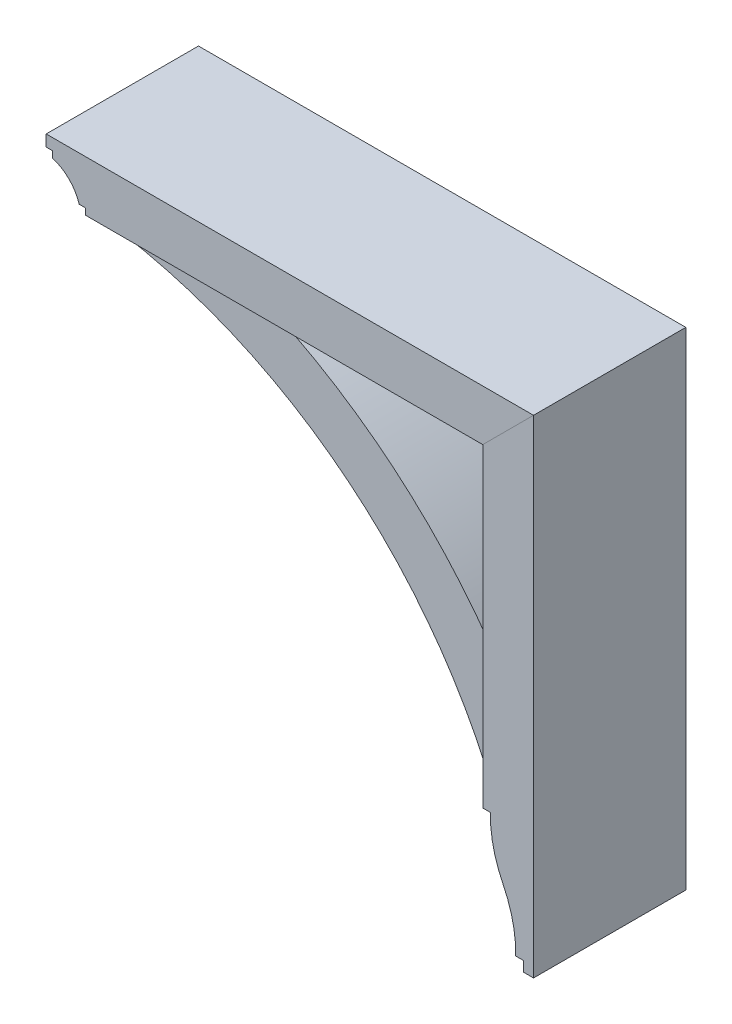
ISO-10303-21;
HEADER;
FILE_DESCRIPTION(('STEP AP214'),'2;1');
FILE_NAME('part.step','',(''),(''),'','','');
FILE_SCHEMA(('AUTOMOTIVE_DESIGN { 1 0 10303 214 1 1 1 1 }'));
ENDSEC;
DATA;
#1=APPLICATION_CONTEXT('core data for automotive mechanical design processes');
#2=APPLICATION_PROTOCOL_DEFINITION('international standard','automotive_design',2000,#1);
#3=PRODUCT_CONTEXT('',#1,'mechanical');
#4=PRODUCT('Part','Part','',(#3));
#5=PRODUCT_RELATED_PRODUCT_CATEGORY('part','',(#4));
#6=PRODUCT_DEFINITION_FORMATION('','',#4);
#7=PRODUCT_DEFINITION_CONTEXT('part definition',#1,'design');
#8=PRODUCT_DEFINITION('design','',#6,#7);
#9=PRODUCT_DEFINITION_SHAPE('','',#8);
#10=(LENGTH_UNIT() NAMED_UNIT(*) SI_UNIT(.MILLI.,.METRE.));
#11=(NAMED_UNIT(*) PLANE_ANGLE_UNIT() SI_UNIT($,.RADIAN.));
#12=(NAMED_UNIT(*) SI_UNIT($,.STERADIAN.) SOLID_ANGLE_UNIT());
#13=UNCERTAINTY_MEASURE_WITH_UNIT(LENGTH_MEASURE(1.E-05),#10,'distance_accuracy_value','');
#14=(GEOMETRIC_REPRESENTATION_CONTEXT(3) GLOBAL_UNCERTAINTY_ASSIGNED_CONTEXT((#13)) GLOBAL_UNIT_ASSIGNED_CONTEXT((#10,
#11,#12)) REPRESENTATION_CONTEXT('',''));
#15=CARTESIAN_POINT('',(0.,0.,0.));
#16=DIRECTION('',(0.,0.,1.));
#17=DIRECTION('',(1.,0.,0.));
#18=AXIS2_PLACEMENT_3D('',#15,#16,#17);
#19=CARTESIAN_POINT('',(0.,-183.515,95.25));
#20=DIRECTION('',(0.,1.,0.));
#21=DIRECTION('',(0.,0.,1.));
#22=AXIS2_PLACEMENT_3D('',#19,#20,#21);
#23=PLANE('',#22);
#24=DIRECTION('',(1.,0.,0.));
#25=VECTOR('',#24,1.);
#26=CARTESIAN_POINT('',(0.,-183.515,-95.25));
#27=LINE('',#26,#25);
#28=CARTESIAN_POINT('',(234.181223015556,-183.515,-95.25));
#29=VERTEX_POINT('',#28);
#30=CARTESIAN_POINT('',(243.706223015556,-183.515,-95.25));
#31=VERTEX_POINT('',#30);
#32=EDGE_CURVE('E169',#29,#31,#27,.T.);
#33=ORIENTED_EDGE('',*,*,#32,.T.);
#34=DIRECTION('',(0.,0.,-1.));
#35=VECTOR('',#34,1.);
#36=CARTESIAN_POINT('',(243.706223015556,-183.515,95.25));
#37=LINE('',#36,#35);
#38=CARTESIAN_POINT('',(243.706223015556,-183.515,95.25));
#39=VERTEX_POINT('',#38);
#40=EDGE_CURVE('E12',#39,#31,#37,.T.);
#41=ORIENTED_EDGE('',*,*,#40,.F.);
#42=DIRECTION('',(1.,0.,0.));
#43=VECTOR('',#42,1.);
#44=CARTESIAN_POINT('',(0.,-183.515,95.25));
#45=LINE('',#44,#43);
#46=CARTESIAN_POINT('',(234.181223015556,-183.515,95.25));
#47=VERTEX_POINT('',#46);
#48=EDGE_CURVE('E198',#47,#39,#45,.T.);
#49=ORIENTED_EDGE('',*,*,#48,.F.);
#50=DIRECTION('',(0.,0.,-1.));
#51=VECTOR('',#50,1.);
#52=CARTESIAN_POINT('',(234.181223015556,-183.515,95.25));
#53=LINE('',#52,#51);
#54=EDGE_CURVE('E165',#47,#29,#53,.T.);
#55=ORIENTED_EDGE('',*,*,#54,.T.);
#56=EDGE_LOOP('',(#33,#41,#49,#55));
#57=FACE_BOUND('',#56,.T.);
#58=ADVANCED_FACE('F60',(#57),#23,.F.);
#59=CARTESIAN_POINT('',(394.498691596048,-185.972961686252,95.25));
#60=DIRECTION('',(0.,0.,-1.));
#61=DIRECTION('',(-1.,0.,0.));
#62=AXIS2_PLACEMENT_3D('',#59,#60,#61);
#63=CYLINDRICAL_SURFACE('',#62,150.8125);
#64=CARTESIAN_POINT('',(394.498691596048,-185.972961686252,-95.25));
#65=DIRECTION('',(0.,0.,1.));
#66=DIRECTION('',(1.,0.,0.));
#67=AXIS2_PLACEMENT_3D('',#64,#65,#66);
#68=CIRCLE('',#67,150.8125);
#69=CARTESIAN_POINT('',(259.581223015556,-253.365,-95.25));
#70=VERTEX_POINT('',#69);
#71=EDGE_CURVE('E173',#31,#70,#68,.T.);
#72=ORIENTED_EDGE('',*,*,#71,.T.);
#73=DIRECTION('',(0.,0.,-1.));
#74=VECTOR('',#73,1.);
#75=CARTESIAN_POINT('',(259.581223015556,-253.365,95.25));
#76=LINE('',#75,#74);
#77=CARTESIAN_POINT('',(259.581223015556,-253.365,95.25));
#78=VERTEX_POINT('',#77);
#79=EDGE_CURVE('E69',#78,#70,#76,.T.);
#80=ORIENTED_EDGE('',*,*,#79,.F.);
#81=CARTESIAN_POINT('',(394.498691596048,-185.972961686252,95.25));
#82=DIRECTION('',(0.,0.,1.));
#83=DIRECTION('',(1.,0.,0.));
#84=AXIS2_PLACEMENT_3D('',#81,#82,#83);
#85=CIRCLE('',#84,150.8125);
#86=EDGE_CURVE('E123',#39,#78,#85,.T.);
#87=ORIENTED_EDGE('',*,*,#86,.F.);
#88=ORIENTED_EDGE('',*,*,#40,.T.);
#89=EDGE_LOOP('',(#72,#80,#87,#88));
#90=FACE_BOUND('',#89,.T.);
#91=ADVANCED_FACE('F220',(#90),#63,.T.);
#92=CARTESIAN_POINT('',(124.663754435066,-320.757038313746,95.25));
#93=DIRECTION('',(0.,0.,-1.));
#94=DIRECTION('',(-1.,0.,0.));
#95=AXIS2_PLACEMENT_3D('',#92,#93,#94);
#96=CYLINDRICAL_SURFACE('',#95,150.812499999996);
#97=CARTESIAN_POINT('',(124.663754435066,-320.757038313746,-95.25));
#98=DIRECTION('',(0.,0.,1.));
#99=DIRECTION('',(1.,0.,0.));
#100=AXIS2_PLACEMENT_3D('',#97,#98,#99);
#101=CIRCLE('',#100,150.812499999996);
#102=CARTESIAN_POINT('',(275.456223015555,-323.215,-95.25));
#103=VERTEX_POINT('',#102);
#104=EDGE_CURVE('E176',#103,#70,#101,.T.);
#105=ORIENTED_EDGE('',*,*,#104,.F.);
#106=DIRECTION('',(0.,0.,-1.));
#107=VECTOR('',#106,1.);
#108=CARTESIAN_POINT('',(275.456223015555,-323.215,95.25));
#109=LINE('',#108,#107);
#110=CARTESIAN_POINT('',(275.456223015555,-323.215,95.25));
#111=VERTEX_POINT('',#110);
#112=EDGE_CURVE('E211',#111,#103,#109,.T.);
#113=ORIENTED_EDGE('',*,*,#112,.F.);
#114=CARTESIAN_POINT('',(124.663754435066,-320.757038313746,95.25));
#115=DIRECTION('',(0.,0.,1.));
#116=DIRECTION('',(1.,0.,0.));
#117=AXIS2_PLACEMENT_3D('',#114,#115,#116);
#118=CIRCLE('',#117,150.812499999996);
#119=EDGE_CURVE('E219',#111,#78,#118,.T.);
#120=ORIENTED_EDGE('',*,*,#119,.T.);
#121=ORIENTED_EDGE('',*,*,#79,.T.);
#122=EDGE_LOOP('',(#105,#113,#120,#121));
#123=FACE_BOUND('',#122,.T.);
#124=ADVANCED_FACE('F217',(#123),#96,.F.);
#125=CARTESIAN_POINT('',(1.88367839844737E-12,-323.215000000002,95.25));
#126=DIRECTION('',(0.,-1.,0.));
#127=DIRECTION('',(1.,0.,0.));
#128=AXIS2_PLACEMENT_3D('',#125,#126,#127);
#129=PLANE('',#128);
#130=DIRECTION('',(-1.,0.,0.));
#131=VECTOR('',#130,1.);
#132=CARTESIAN_POINT('',(1.88367839844737E-12,-323.215000000002,-95.25));
#133=LINE('',#132,#131);
#134=CARTESIAN_POINT('',(284.981223015555,-323.215,-95.25));
#135=VERTEX_POINT('',#134);
#136=EDGE_CURVE('E180',#135,#103,#133,.T.);
#137=ORIENTED_EDGE('',*,*,#136,.F.);
#138=DIRECTION('',(0.,0.,-1.));
#139=VECTOR('',#138,1.);
#140=CARTESIAN_POINT('',(284.981223015555,-323.215,95.25));
#141=LINE('',#140,#139);
#142=CARTESIAN_POINT('',(284.981223015555,-323.215,95.25));
#143=VERTEX_POINT('',#142);
#144=EDGE_CURVE('E208',#143,#135,#141,.T.);
#145=ORIENTED_EDGE('',*,*,#144,.F.);
#146=DIRECTION('',(-1.,0.,0.));
#147=VECTOR('',#146,1.);
#148=CARTESIAN_POINT('',(1.88367839844737E-12,-323.215000000002,95.25));
#149=LINE('',#148,#147);
#150=EDGE_CURVE('E231',#143,#111,#149,.T.);
#151=ORIENTED_EDGE('',*,*,#150,.T.);
#152=ORIENTED_EDGE('',*,*,#112,.T.);
#153=EDGE_LOOP('',(#137,#145,#151,#152));
#154=FACE_BOUND('',#153,.T.);
#155=ADVANCED_FACE('F228',(#154),#129,.T.);
#156=CARTESIAN_POINT('',(284.981223015554,1.24564061172325E-12,95.25));
#157=DIRECTION('',(-1.,0.,0.));
#158=DIRECTION('',(0.,-1.,0.));
#159=AXIS2_PLACEMENT_3D('',#156,#157,#158);
#160=PLANE('',#159);
#161=DIRECTION('',(0.,1.,0.));
#162=VECTOR('',#161,1.);
#163=CARTESIAN_POINT('',(284.981223015554,1.24564061172325E-12,-95.25));
#164=LINE('',#163,#162);
#165=CARTESIAN_POINT('',(284.981223015555,-335.915,-95.25));
#166=VERTEX_POINT('',#165);
#167=EDGE_CURVE('E184',#166,#135,#164,.T.);
#168=ORIENTED_EDGE('',*,*,#167,.F.);
#169=DIRECTION('',(0.,0.,-1.));
#170=VECTOR('',#169,1.);
#171=CARTESIAN_POINT('',(284.981223015555,-335.915,95.25));
#172=LINE('',#171,#170);
#173=CARTESIAN_POINT('',(284.981223015555,-335.915,95.25));
#174=VERTEX_POINT('',#173);
#175=EDGE_CURVE('E205',#174,#166,#172,.T.);
#176=ORIENTED_EDGE('',*,*,#175,.F.);
#177=DIRECTION('',(0.,1.,0.));
#178=VECTOR('',#177,1.);
#179=CARTESIAN_POINT('',(284.981223015554,1.24564061172325E-12,95.25));
#180=LINE('',#179,#178);
#181=EDGE_CURVE('E236',#174,#143,#180,.T.);
#182=ORIENTED_EDGE('',*,*,#181,.T.);
#183=ORIENTED_EDGE('',*,*,#144,.T.);
#184=EDGE_LOOP('',(#168,#176,#182,#183));
#185=FACE_BOUND('',#184,.T.);
#186=ADVANCED_FACE('F269',(#185),#160,.T.);
#187=CARTESIAN_POINT('',(-1.46826995006676E-12,-335.914999999999,95.25));
#188=DIRECTION('',(0.,-1.,0.));
#189=DIRECTION('',(1.,0.,0.));
#190=AXIS2_PLACEMENT_3D('',#187,#188,#189);
#191=PLANE('',#190);
#192=DIRECTION('',(-1.,0.,0.));
#193=VECTOR('',#192,1.);
#194=CARTESIAN_POINT('',(-1.46826995006676E-12,-335.914999999999,-95.25));
#195=LINE('',#194,#193);
#196=CARTESIAN_POINT('',(297.681223015555,-335.915,-95.25));
#197=VERTEX_POINT('',#196);
#198=EDGE_CURVE('E188',#197,#166,#195,.T.);
#199=ORIENTED_EDGE('',*,*,#198,.F.);
#200=DIRECTION('',(0.,0.,-1.));
#201=VECTOR('',#200,1.);
#202=CARTESIAN_POINT('',(297.681223015555,-335.915,95.25));
#203=LINE('',#202,#201);
#204=CARTESIAN_POINT('',(297.681223015555,-335.915,95.25));
#205=VERTEX_POINT('',#204);
#206=EDGE_CURVE('E156',#205,#197,#203,.T.);
#207=ORIENTED_EDGE('',*,*,#206,.F.);
#208=DIRECTION('',(-1.,0.,0.));
#209=VECTOR('',#208,1.);
#210=CARTESIAN_POINT('',(-1.46826995006676E-12,-335.914999999999,95.25));
#211=LINE('',#210,#209);
#212=EDGE_CURVE('E147',#205,#174,#211,.T.);
#213=ORIENTED_EDGE('',*,*,#212,.T.);
#214=ORIENTED_EDGE('',*,*,#175,.T.);
#215=EDGE_LOOP('',(#199,#207,#213,#214));
#216=FACE_BOUND('',#215,.T.);
#217=ADVANCED_FACE('F245',(#216),#191,.T.);
#218=CARTESIAN_POINT('',(297.681223015555,0.,95.25));
#219=DIRECTION('',(-1.,0.,0.));
#220=DIRECTION('',(0.,-1.,0.));
#221=AXIS2_PLACEMENT_3D('',#218,#219,#220);
#222=PLANE('',#221);
#223=DIRECTION('',(0.,1.,0.));
#224=VECTOR('',#223,1.);
#225=CARTESIAN_POINT('',(297.681223015555,0.,-95.25));
#226=LINE('',#225,#224);
#227=CARTESIAN_POINT('',(297.681223015555,273.685,-95.25));
#228=VERTEX_POINT('',#227);
#229=EDGE_CURVE('E154',#197,#228,#226,.T.);
#230=ORIENTED_EDGE('',*,*,#229,.T.);
#231=DIRECTION('',(0.,0.,-1.));
#232=VECTOR('',#231,1.);
#233=CARTESIAN_POINT('',(297.681223015555,273.685,95.25));
#234=LINE('',#233,#232);
#235=CARTESIAN_POINT('',(297.681223015555,273.685,95.25));
#236=VERTEX_POINT('',#235);
#237=EDGE_CURVE('E151',#236,#228,#234,.T.);
#238=ORIENTED_EDGE('',*,*,#237,.F.);
#239=DIRECTION('',(0.,1.,0.));
#240=VECTOR('',#239,1.);
#241=CARTESIAN_POINT('',(297.681223015555,0.,95.25));
#242=LINE('',#241,#240);
#243=EDGE_CURVE('E140',#205,#236,#242,.T.);
#244=ORIENTED_EDGE('',*,*,#243,.F.);
#245=ORIENTED_EDGE('',*,*,#206,.T.);
#246=EDGE_LOOP('',(#230,#238,#244,#245));
#247=FACE_BOUND('',#246,.T.);
#248=ADVANCED_FACE('F152',(#247),#222,.F.);
#249=CARTESIAN_POINT('',(11.9981115077795,-11.9981115077793,95.25));
#250=DIRECTION('',(0.707106781186552,-0.707106781186543,0.));
#251=DIRECTION('',(0.707106781186543,0.707106781186552,0.));
#252=AXIS2_PLACEMENT_3D('',#249,#250,#251);
#253=PLANE('',#252);
#254=DIRECTION('',(-0.707106781186543,-0.707106781186552,0.));
#255=VECTOR('',#254,1.);
#256=CARTESIAN_POINT('',(11.9981115077795,-11.9981115077793,-95.25));
#257=LINE('',#256,#255);
#258=CARTESIAN_POINT('',(234.181223015556,210.185,-95.25));
#259=VERTEX_POINT('',#258);
#260=EDGE_CURVE('E109',#228,#259,#257,.T.);
#261=ORIENTED_EDGE('',*,*,#260,.T.);
#262=DIRECTION('',(0.,0.,-1.));
#263=VECTOR('',#262,1.);
#264=CARTESIAN_POINT('',(234.181223015556,210.185,95.25));
#265=LINE('',#264,#263);
#266=CARTESIAN_POINT('',(234.181223015556,210.185,95.25));
#267=VERTEX_POINT('',#266);
#268=EDGE_CURVE('E157',#267,#259,#265,.T.);
#269=ORIENTED_EDGE('',*,*,#268,.F.);
#270=DIRECTION('',(-0.707106781186543,-0.707106781186552,0.));
#271=VECTOR('',#270,1.);
#272=CARTESIAN_POINT('',(11.9981115077795,-11.9981115077793,95.25));
#273=LINE('',#272,#271);
#274=EDGE_CURVE('E144',#236,#267,#273,.T.);
#275=ORIENTED_EDGE('',*,*,#274,.F.);
#276=ORIENTED_EDGE('',*,*,#237,.T.);
#277=EDGE_LOOP('',(#261,#269,#275,#276));
#278=FACE_BOUND('',#277,.T.);
#279=ADVANCED_FACE('F159',(#278),#253,.F.);
#280=CARTESIAN_POINT('',(234.181223015556,0.,95.25));
#281=DIRECTION('',(1.,0.,0.));
#282=DIRECTION('',(0.,1.,0.));
#283=AXIS2_PLACEMENT_3D('',#280,#281,#282);
#284=PLANE('',#283);
#285=DIRECTION('',(0.,-1.,0.));
#286=VECTOR('',#285,1.);
#287=CARTESIAN_POINT('',(234.181223015556,0.,-95.25));
#288=LINE('',#287,#286);
#289=EDGE_CURVE('E115',#259,#29,#288,.T.);
#290=ORIENTED_EDGE('',*,*,#289,.T.);
#291=ORIENTED_EDGE('',*,*,#54,.F.);
#292=DIRECTION('',(0.,-1.,0.));
#293=VECTOR('',#292,1.);
#294=CARTESIAN_POINT('',(234.181223015556,0.,95.25));
#295=LINE('',#294,#293);
#296=EDGE_CURVE('E77',#267,#47,#295,.T.);
#297=ORIENTED_EDGE('',*,*,#296,.F.);
#298=ORIENTED_EDGE('',*,*,#268,.T.);
#299=EDGE_LOOP('',(#290,#291,#297,#298));
#300=FACE_BOUND('',#299,.T.);
#301=ADVANCED_FACE('F248',(#300),#284,.F.);
#302=CARTESIAN_POINT('',(0.,0.,95.25));
#303=DIRECTION('',(0.,0.,1.));
#304=DIRECTION('',(1.,0.,0.));
#305=AXIS2_PLACEMENT_3D('',#302,#303,#304);
#306=PLANE('',#305);
#307=ORIENTED_EDGE('',*,*,#48,.T.);
#308=ORIENTED_EDGE('',*,*,#86,.T.);
#309=ORIENTED_EDGE('',*,*,#119,.F.);
#310=ORIENTED_EDGE('',*,*,#150,.F.);
#311=ORIENTED_EDGE('',*,*,#181,.F.);
#312=ORIENTED_EDGE('',*,*,#212,.F.);
#313=ORIENTED_EDGE('',*,*,#243,.T.);
#314=ORIENTED_EDGE('',*,*,#274,.T.);
#315=ORIENTED_EDGE('',*,*,#296,.T.);
#316=EDGE_LOOP('',(#307,#308,#309,#310,#311,#312,#313,#314,#315));
#317=FACE_BOUND('',#316,.T.);
#318=ADVANCED_FACE('F142',(#317),#306,.T.);
#319=CARTESIAN_POINT('',(0.,0.,-95.25));
#320=DIRECTION('',(0.,0.,1.));
#321=DIRECTION('',(1.,0.,0.));
#322=AXIS2_PLACEMENT_3D('',#319,#320,#321);
#323=PLANE('',#322);
#324=ORIENTED_EDGE('',*,*,#32,.F.);
#325=ORIENTED_EDGE('',*,*,#289,.F.);
#326=ORIENTED_EDGE('',*,*,#260,.F.);
#327=ORIENTED_EDGE('',*,*,#229,.F.);
#328=ORIENTED_EDGE('',*,*,#198,.T.);
#329=ORIENTED_EDGE('',*,*,#167,.T.);
#330=ORIENTED_EDGE('',*,*,#136,.T.);
#331=ORIENTED_EDGE('',*,*,#104,.T.);
#332=ORIENTED_EDGE('',*,*,#71,.F.);
#333=EDGE_LOOP('',(#324,#325,#326,#327,#328,#329,#330,#331,#332));
#334=FACE_BOUND('',#333,.T.);
#335=ADVANCED_FACE('F224',(#334),#323,.F.);
#336=CLOSED_SHELL('',(#58,#91,#124,#155,#186,#217,#248,#279,#301,#318,#335));
#337=MANIFOLD_SOLID_BREP('B2',#336);
#338=CARTESIAN_POINT('',(-334.570737895892,-414.691103093737,69.85));
#339=DIRECTION('',(0.,0.,-1.));
#340=DIRECTION('',(-1.,0.,0.));
#341=AXIS2_PLACEMENT_3D('',#338,#339,#340);
#342=CYLINDRICAL_SURFACE('',#341,674.6875);
#343=CARTESIAN_POINT('',(-334.570737895892,-414.691103093737,-69.85));
#344=DIRECTION('',(0.,0.,1.));
#345=DIRECTION('',(1.,0.,0.));
#346=AXIS2_PLACEMENT_3D('',#343,#344,#345);
#347=CIRCLE('',#346,674.6875);
#348=CARTESIAN_POINT('',(-80.1437769844444,210.185,-69.85));
#349=VERTEX_POINT('',#348);
#350=CARTESIAN_POINT('',(234.181223015556,-51.7525000000003,-69.85));
#351=VERTEX_POINT('',#350);
#352=EDGE_CURVE('E461',#349,#351,#347,.F.);
#353=ORIENTED_EDGE('',*,*,#352,.F.);
#354=DIRECTION('',(0.,0.,-1.));
#355=VECTOR('',#354,1.);
#356=CARTESIAN_POINT('',(-80.1437769844444,210.185,69.85));
#357=LINE('',#356,#355);
#358=CARTESIAN_POINT('',(-80.1437769844444,210.185,69.85));
#359=VERTEX_POINT('',#358);
#360=EDGE_CURVE('E58',#359,#349,#357,.T.);
#361=ORIENTED_EDGE('',*,*,#360,.F.);
#362=CARTESIAN_POINT('',(-334.570737895892,-414.691103093737,69.85));
#363=DIRECTION('',(0.,0.,1.));
#364=DIRECTION('',(1.,0.,0.));
#365=AXIS2_PLACEMENT_3D('',#362,#363,#364);
#366=CIRCLE('',#365,674.6875);
#367=CARTESIAN_POINT('',(234.181223015556,-51.7525000000003,69.85));
#368=VERTEX_POINT('',#367);
#369=EDGE_CURVE('E478',#359,#368,#366,.F.);
#370=ORIENTED_EDGE('',*,*,#369,.T.);
#371=DIRECTION('',(0.,0.,-1.));
#372=VECTOR('',#371,1.);
#373=CARTESIAN_POINT('',(234.181223015556,-51.7525000000003,69.85));
#374=LINE('',#373,#372);
#375=EDGE_CURVE('E389',#368,#351,#374,.T.);
#376=ORIENTED_EDGE('',*,*,#375,.T.);
#377=EDGE_LOOP('',(#353,#361,#370,#376));
#378=FACE_BOUND('',#377,.T.);
#379=ADVANCED_FACE('F372',(#378),#342,.T.);
#380=CARTESIAN_POINT('',(0.,210.185,69.85));
#381=DIRECTION('',(0.,1.,0.));
#382=DIRECTION('',(-1.,0.,0.));
#383=AXIS2_PLACEMENT_3D('',#380,#381,#382);
#384=PLANE('',#383);
#385=DIRECTION('',(1.,0.,0.));
#386=VECTOR('',#385,1.);
#387=CARTESIAN_POINT('',(0.,210.185,-69.85));
#388=LINE('',#387,#386);
#389=CARTESIAN_POINT('',(-240.481276984445,210.185,-69.85));
#390=VERTEX_POINT('',#389);
#391=EDGE_CURVE('E464',#390,#349,#388,.T.);
#392=ORIENTED_EDGE('',*,*,#391,.F.);
#393=DIRECTION('',(0.,0.,-1.));
#394=VECTOR('',#393,1.);
#395=CARTESIAN_POINT('',(-240.481276984445,210.185,69.85));
#396=LINE('',#395,#394);
#397=CARTESIAN_POINT('',(-240.481276984445,210.185,69.85));
#398=VERTEX_POINT('',#397);
#399=EDGE_CURVE('E381',#398,#390,#396,.T.);
#400=ORIENTED_EDGE('',*,*,#399,.F.);
#401=DIRECTION('',(1.,0.,0.));
#402=VECTOR('',#401,1.);
#403=CARTESIAN_POINT('',(0.,210.185,69.85));
#404=LINE('',#403,#402);
#405=EDGE_CURVE('E494',#398,#359,#404,.T.);
#406=ORIENTED_EDGE('',*,*,#405,.T.);
#407=ORIENTED_EDGE('',*,*,#360,.T.);
#408=EDGE_LOOP('',(#392,#400,#406,#407));
#409=FACE_BOUND('',#408,.T.);
#410=ADVANCED_FACE('F493',(#409),#384,.T.);
#411=CARTESIAN_POINT('',(-240.481276984445,-3.00323791562869E-13,69.85));
#412=DIRECTION('',(1.,0.,0.));
#413=DIRECTION('',(0.,1.,0.));
#414=AXIS2_PLACEMENT_3D('',#411,#412,#413);
#415=PLANE('',#414);
#416=DIRECTION('',(0.,-1.,0.));
#417=VECTOR('',#416,1.);
#418=CARTESIAN_POINT('',(-240.481276984445,-3.00323791562869E-13,-69.85));
#419=LINE('',#418,#417);
#420=CARTESIAN_POINT('',(-240.481276984445,187.96,-69.85));
#421=VERTEX_POINT('',#420);
#422=EDGE_CURVE('E467',#390,#421,#419,.T.);
#423=ORIENTED_EDGE('',*,*,#422,.T.);
#424=DIRECTION('',(0.,0.,-1.));
#425=VECTOR('',#424,1.);
#426=CARTESIAN_POINT('',(-240.481276984445,187.96,69.85));
#427=LINE('',#426,#425);
#428=CARTESIAN_POINT('',(-240.481276984445,187.96,69.85));
#429=VERTEX_POINT('',#428);
#430=EDGE_CURVE('E449',#429,#421,#427,.T.);
#431=ORIENTED_EDGE('',*,*,#430,.F.);
#432=DIRECTION('',(0.,-1.,0.));
#433=VECTOR('',#432,1.);
#434=CARTESIAN_POINT('',(-240.481276984445,-3.00323791562869E-13,69.85));
#435=LINE('',#434,#433);
#436=EDGE_CURVE('E435',#398,#429,#435,.T.);
#437=ORIENTED_EDGE('',*,*,#436,.F.);
#438=ORIENTED_EDGE('',*,*,#399,.T.);
#439=EDGE_LOOP('',(#423,#431,#437,#438));
#440=FACE_BOUND('',#439,.T.);
#441=ADVANCED_FACE('F487',(#440),#415,.F.);
#442=CARTESIAN_POINT('',(-342.193449871431,-411.484604649052,69.85));
#443=DIRECTION('',(0.,0.,-1.));
#444=DIRECTION('',(-1.,0.,0.));
#445=AXIS2_PLACEMENT_3D('',#442,#443,#444);
#446=CYLINDRICAL_SURFACE('',#445,608.0125);
#447=CARTESIAN_POINT('',(-342.193449871431,-411.484604649052,-69.85));
#448=DIRECTION('',(0.,0.,1.));
#449=DIRECTION('',(1.,0.,0.));
#450=AXIS2_PLACEMENT_3D('',#447,#448,#449);
#451=CIRCLE('',#450,608.0125);
#452=CARTESIAN_POINT('',(211.956223015556,-161.29,-69.85));
#453=VERTEX_POINT('',#452);
#454=EDGE_CURVE('E445',#421,#453,#451,.F.);
#455=ORIENTED_EDGE('',*,*,#454,.T.);
#456=DIRECTION('',(0.,0.,-1.));
#457=VECTOR('',#456,1.);
#458=CARTESIAN_POINT('',(211.956223015556,-161.29,69.85));
#459=LINE('',#458,#457);
#460=CARTESIAN_POINT('',(211.956223015556,-161.29,69.85));
#461=VERTEX_POINT('',#460);
#462=EDGE_CURVE('E442',#461,#453,#459,.T.);
#463=ORIENTED_EDGE('',*,*,#462,.F.);
#464=CARTESIAN_POINT('',(-342.193449871431,-411.484604649052,69.85));
#465=DIRECTION('',(0.,0.,1.));
#466=DIRECTION('',(1.,0.,0.));
#467=AXIS2_PLACEMENT_3D('',#464,#465,#466);
#468=CIRCLE('',#467,608.0125);
#469=EDGE_CURVE('E427',#429,#461,#468,.F.);
#470=ORIENTED_EDGE('',*,*,#469,.F.);
#471=ORIENTED_EDGE('',*,*,#430,.T.);
#472=EDGE_LOOP('',(#455,#463,#470,#471));
#473=FACE_BOUND('',#472,.T.);
#474=ADVANCED_FACE('F443',(#473),#446,.F.);
#475=CARTESIAN_POINT('',(-2.0142617732485E-13,-161.29,69.85));
#476=DIRECTION('',(0.,-1.,0.));
#477=DIRECTION('',(1.,0.,0.));
#478=AXIS2_PLACEMENT_3D('',#475,#476,#477);
#479=PLANE('',#478);
#480=DIRECTION('',(-1.,0.,0.));
#481=VECTOR('',#480,1.);
#482=CARTESIAN_POINT('',(-2.0142617732485E-13,-161.29,-69.85));
#483=LINE('',#482,#481);
#484=CARTESIAN_POINT('',(234.181223015556,-161.29,-69.85));
#485=VERTEX_POINT('',#484);
#486=EDGE_CURVE('E472',#485,#453,#483,.T.);
#487=ORIENTED_EDGE('',*,*,#486,.F.);
#488=DIRECTION('',(0.,0.,-1.));
#489=VECTOR('',#488,1.);
#490=CARTESIAN_POINT('',(234.181223015556,-161.29,69.85));
#491=LINE('',#490,#489);
#492=CARTESIAN_POINT('',(234.181223015556,-161.29,69.85));
#493=VERTEX_POINT('',#492);
#494=EDGE_CURVE('E408',#493,#485,#491,.T.);
#495=ORIENTED_EDGE('',*,*,#494,.F.);
#496=DIRECTION('',(-1.,0.,0.));
#497=VECTOR('',#496,1.);
#498=CARTESIAN_POINT('',(-2.0142617732485E-13,-161.29,69.85));
#499=LINE('',#498,#497);
#500=EDGE_CURVE('E432',#493,#461,#499,.T.);
#501=ORIENTED_EDGE('',*,*,#500,.T.);
#502=ORIENTED_EDGE('',*,*,#462,.T.);
#503=EDGE_LOOP('',(#487,#495,#501,#502));
#504=FACE_BOUND('',#503,.T.);
#505=ADVANCED_FACE('F451',(#504),#479,.T.);
#506=CARTESIAN_POINT('',(234.181223015556,0.,69.85));
#507=DIRECTION('',(1.,0.,0.));
#508=DIRECTION('',(0.,1.,0.));
#509=AXIS2_PLACEMENT_3D('',#506,#507,#508);
#510=PLANE('',#509);
#511=DIRECTION('',(0.,-1.,0.));
#512=VECTOR('',#511,1.);
#513=CARTESIAN_POINT('',(234.181223015556,0.,-69.85));
#514=LINE('',#513,#512);
#515=EDGE_CURVE('E474',#351,#485,#514,.T.);
#516=ORIENTED_EDGE('',*,*,#515,.F.);
#517=ORIENTED_EDGE('',*,*,#375,.F.);
#518=DIRECTION('',(0.,-1.,0.));
#519=VECTOR('',#518,1.);
#520=CARTESIAN_POINT('',(234.181223015556,0.,69.85));
#521=LINE('',#520,#519);
#522=EDGE_CURVE('E453',#368,#493,#521,.T.);
#523=ORIENTED_EDGE('',*,*,#522,.T.);
#524=ORIENTED_EDGE('',*,*,#494,.T.);
#525=EDGE_LOOP('',(#516,#517,#523,#524));
#526=FACE_BOUND('',#525,.T.);
#527=ADVANCED_FACE('F495',(#526),#510,.T.);
#528=CARTESIAN_POINT('',(0.,0.,69.85));
#529=DIRECTION('',(0.,0.,1.));
#530=DIRECTION('',(1.,0.,0.));
#531=AXIS2_PLACEMENT_3D('',#528,#529,#530);
#532=PLANE('',#531);
#533=ORIENTED_EDGE('',*,*,#369,.F.);
#534=ORIENTED_EDGE('',*,*,#405,.F.);
#535=ORIENTED_EDGE('',*,*,#436,.T.);
#536=ORIENTED_EDGE('',*,*,#469,.T.);
#537=ORIENTED_EDGE('',*,*,#500,.F.);
#538=ORIENTED_EDGE('',*,*,#522,.F.);
#539=EDGE_LOOP('',(#533,#534,#535,#536,#537,#538));
#540=FACE_BOUND('',#539,.T.);
#541=ADVANCED_FACE('F429',(#540),#532,.T.);
#542=CARTESIAN_POINT('',(0.,0.,-69.85));
#543=DIRECTION('',(0.,0.,1.));
#544=DIRECTION('',(1.,0.,0.));
#545=AXIS2_PLACEMENT_3D('',#542,#543,#544);
#546=PLANE('',#545);
#547=ORIENTED_EDGE('',*,*,#352,.T.);
#548=ORIENTED_EDGE('',*,*,#515,.T.);
#549=ORIENTED_EDGE('',*,*,#486,.T.);
#550=ORIENTED_EDGE('',*,*,#454,.F.);
#551=ORIENTED_EDGE('',*,*,#422,.F.);
#552=ORIENTED_EDGE('',*,*,#391,.T.);
#553=EDGE_LOOP('',(#547,#548,#549,#550,#551,#552));
#554=FACE_BOUND('',#553,.T.);
#555=ADVANCED_FACE('F492',(#554),#546,.F.);
#556=CLOSED_SHELL('',(#379,#410,#441,#474,#505,#527,#541,#555));
#557=MANIFOLD_SOLID_BREP('B6',#556);
#558=CARTESIAN_POINT('',(-303.981276984449,4.25180488520432E-12,95.25));
#559=DIRECTION('',(-1.,0.,0.));
#560=DIRECTION('',(0.,-1.,0.));
#561=AXIS2_PLACEMENT_3D('',#558,#559,#560);
#562=PLANE('',#561);
#563=DIRECTION('',(0.,1.,0.));
#564=VECTOR('',#563,1.);
#565=CARTESIAN_POINT('',(-303.981276984449,4.25180488520432E-12,-95.25));
#566=LINE('',#565,#564);
#567=CARTESIAN_POINT('',(-303.981276984445,251.46,-95.25));
#568=VERTEX_POINT('',#567);
#569=CARTESIAN_POINT('',(-303.981276984445,259.3975,-95.25));
#570=VERTEX_POINT('',#569);
#571=EDGE_CURVE('E689',#568,#570,#566,.T.);
#572=ORIENTED_EDGE('',*,*,#571,.F.);
#573=DIRECTION('',(0.,0.,-1.));
#574=VECTOR('',#573,1.);
#575=CARTESIAN_POINT('',(-303.981276984445,251.46,95.25));
#576=LINE('',#575,#574);
#577=CARTESIAN_POINT('',(-303.981276984445,251.46,95.25));
#578=VERTEX_POINT('',#577);
#579=EDGE_CURVE('E370',#578,#568,#576,.T.);
#580=ORIENTED_EDGE('',*,*,#579,.F.);
#581=DIRECTION('',(0.,1.,0.));
#582=VECTOR('',#581,1.);
#583=CARTESIAN_POINT('',(-303.981276984449,4.25180488520432E-12,95.25));
#584=LINE('',#583,#582);
#585=CARTESIAN_POINT('',(-303.981276984445,259.3975,95.25));
#586=VERTEX_POINT('',#585);
#587=EDGE_CURVE('E720',#578,#586,#584,.T.);
#588=ORIENTED_EDGE('',*,*,#587,.T.);
#589=DIRECTION('',(0.,0.,-1.));
#590=VECTOR('',#589,1.);
#591=CARTESIAN_POINT('',(-303.981276984445,259.3975,95.25));
#592=LINE('',#591,#590);
#593=EDGE_CURVE('E599',#586,#570,#592,.T.);
#594=ORIENTED_EDGE('',*,*,#593,.T.);
#595=EDGE_LOOP('',(#572,#580,#588,#594));
#596=FACE_BOUND('',#595,.T.);
#597=ADVANCED_FACE('F582',(#596),#562,.T.);
#598=CARTESIAN_POINT('',(-319.078740281999,203.025036702446,95.25));
#599=DIRECTION('',(0.,0.,-1.));
#600=DIRECTION('',(-1.,0.,0.));
#601=AXIS2_PLACEMENT_3D('',#598,#599,#600);
#602=CYLINDRICAL_SURFACE('',#601,50.7334117486339);
#603=CARTESIAN_POINT('',(-319.078740281999,203.025036702446,-95.25));
#604=DIRECTION('',(0.,0.,1.));
#605=DIRECTION('',(1.,0.,0.));
#606=AXIS2_PLACEMENT_3D('',#603,#604,#605);
#607=CIRCLE('',#606,50.7334117486339);
#608=CARTESIAN_POINT('',(-270.643776984445,218.1225,-95.25));
#609=VERTEX_POINT('',#608);
#610=EDGE_CURVE('E692',#568,#609,#607,.F.);
#611=ORIENTED_EDGE('',*,*,#610,.T.);
#612=DIRECTION('',(0.,0.,-1.));
#613=VECTOR('',#612,1.);
#614=CARTESIAN_POINT('',(-270.643776984445,218.1225,95.25));
#615=LINE('',#614,#613);
#616=CARTESIAN_POINT('',(-270.643776984445,218.1225,95.25));
#617=VERTEX_POINT('',#616);
#618=EDGE_CURVE('E591',#617,#609,#615,.T.);
#619=ORIENTED_EDGE('',*,*,#618,.F.);
#620=CARTESIAN_POINT('',(-319.078740281999,203.025036702446,95.25));
#621=DIRECTION('',(0.,0.,1.));
#622=DIRECTION('',(1.,0.,0.));
#623=AXIS2_PLACEMENT_3D('',#620,#621,#622);
#624=CIRCLE('',#623,50.7334117486339);
#625=EDGE_CURVE('E757',#578,#617,#624,.F.);
#626=ORIENTED_EDGE('',*,*,#625,.F.);
#627=ORIENTED_EDGE('',*,*,#579,.T.);
#628=EDGE_LOOP('',(#611,#619,#626,#627));
#629=FACE_BOUND('',#628,.T.);
#630=ADVANCED_FACE('F746',(#629),#602,.F.);
#631=CARTESIAN_POINT('',(0.,218.1225,95.25));
#632=DIRECTION('',(0.,-1.,0.));
#633=DIRECTION('',(0.,0.,-1.));
#634=AXIS2_PLACEMENT_3D('',#631,#632,#633);
#635=PLANE('',#634);
#636=DIRECTION('',(-1.,0.,0.));
#637=VECTOR('',#636,1.);
#638=CARTESIAN_POINT('',(0.,218.1225,-95.25));
#639=LINE('',#638,#637);
#640=CARTESIAN_POINT('',(-262.706276984445,218.1225,-95.25));
#641=VERTEX_POINT('',#640);
#642=EDGE_CURVE('E695',#641,#609,#639,.T.);
#643=ORIENTED_EDGE('',*,*,#642,.F.);
#644=DIRECTION('',(0.,0.,-1.));
#645=VECTOR('',#644,1.);
#646=CARTESIAN_POINT('',(-262.706276984445,218.1225,95.25));
#647=LINE('',#646,#645);
#648=CARTESIAN_POINT('',(-262.706276984445,218.1225,95.25));
#649=VERTEX_POINT('',#648);
#650=EDGE_CURVE('E732',#649,#641,#647,.T.);
#651=ORIENTED_EDGE('',*,*,#650,.F.);
#652=DIRECTION('',(-1.,0.,0.));
#653=VECTOR('',#652,1.);
#654=CARTESIAN_POINT('',(0.,218.1225,95.25));
#655=LINE('',#654,#653);
#656=EDGE_CURVE('E743',#649,#617,#655,.T.);
#657=ORIENTED_EDGE('',*,*,#656,.T.);
#658=ORIENTED_EDGE('',*,*,#618,.T.);
#659=EDGE_LOOP('',(#643,#651,#657,#658));
#660=FACE_BOUND('',#659,.T.);
#661=ADVANCED_FACE('F741',(#660),#635,.T.);
#662=CARTESIAN_POINT('',(-262.706276984447,1.8372444561996E-12,95.25));
#663=DIRECTION('',(-1.,0.,0.));
#664=DIRECTION('',(0.,-1.,0.));
#665=AXIS2_PLACEMENT_3D('',#662,#663,#664);
#666=PLANE('',#665);
#667=DIRECTION('',(0.,1.,0.));
#668=VECTOR('',#667,1.);
#669=CARTESIAN_POINT('',(-262.706276984447,1.8372444561996E-12,-95.25));
#670=LINE('',#669,#668);
#671=CARTESIAN_POINT('',(-262.706276984445,210.185,-95.25));
#672=VERTEX_POINT('',#671);
#673=EDGE_CURVE('E699',#672,#641,#670,.T.);
#674=ORIENTED_EDGE('',*,*,#673,.F.);
#675=DIRECTION('',(0.,0.,-1.));
#676=VECTOR('',#675,1.);
#677=CARTESIAN_POINT('',(-262.706276984445,210.185,95.25));
#678=LINE('',#677,#676);
#679=CARTESIAN_POINT('',(-262.706276984445,210.185,95.25));
#680=VERTEX_POINT('',#679);
#681=EDGE_CURVE('E729',#680,#672,#678,.T.);
#682=ORIENTED_EDGE('',*,*,#681,.F.);
#683=DIRECTION('',(0.,1.,0.));
#684=VECTOR('',#683,1.);
#685=CARTESIAN_POINT('',(-262.706276984447,1.8372444561996E-12,95.25));
#686=LINE('',#685,#684);
#687=EDGE_CURVE('E756',#680,#649,#686,.T.);
#688=ORIENTED_EDGE('',*,*,#687,.T.);
#689=ORIENTED_EDGE('',*,*,#650,.T.);
#690=EDGE_LOOP('',(#674,#682,#688,#689));
#691=FACE_BOUND('',#690,.T.);
#692=ADVANCED_FACE('F752',(#691),#666,.T.);
#693=CARTESIAN_POINT('',(0.,210.185,95.25));
#694=DIRECTION('',(0.,1.,0.));
#695=DIRECTION('',(-1.,0.,0.));
#696=AXIS2_PLACEMENT_3D('',#693,#694,#695);
#697=PLANE('',#696);
#698=DIRECTION('',(1.,0.,0.));
#699=VECTOR('',#698,1.);
#700=CARTESIAN_POINT('',(0.,210.185,-95.25));
#701=LINE('',#700,#699);
#702=CARTESIAN_POINT('',(234.181223015556,210.185,-95.25));
#703=VERTEX_POINT('',#702);
#704=EDGE_CURVE('E703',#672,#703,#701,.T.);
#705=ORIENTED_EDGE('',*,*,#704,.T.);
#706=DIRECTION('',(0.,0.,-1.));
#707=VECTOR('',#706,1.);
#708=CARTESIAN_POINT('',(234.181223015556,210.185,95.25));
#709=LINE('',#708,#707);
#710=CARTESIAN_POINT('',(234.181223015556,210.185,95.25));
#711=VERTEX_POINT('',#710);
#712=EDGE_CURVE('E727',#711,#703,#709,.T.);
#713=ORIENTED_EDGE('',*,*,#712,.F.);
#714=DIRECTION('',(1.,0.,0.));
#715=VECTOR('',#714,1.);
#716=CARTESIAN_POINT('',(0.,210.185,95.25));
#717=LINE('',#716,#715);
#718=EDGE_CURVE('E762',#680,#711,#717,.T.);
#719=ORIENTED_EDGE('',*,*,#718,.F.);
#720=ORIENTED_EDGE('',*,*,#681,.T.);
#721=EDGE_LOOP('',(#705,#713,#719,#720));
#722=FACE_BOUND('',#721,.T.);
#723=ADVANCED_FACE('F795',(#722),#697,.F.);
#724=CARTESIAN_POINT('',(11.9981115077795,-11.9981115077793,95.25));
#725=DIRECTION('',(0.707106781186552,-0.707106781186543,0.));
#726=DIRECTION('',(0.707106781186543,0.707106781186552,0.));
#727=AXIS2_PLACEMENT_3D('',#724,#725,#726);
#728=PLANE('',#727);
#729=DIRECTION('',(-0.707106781186543,-0.707106781186552,0.));
#730=VECTOR('',#729,1.);
#731=CARTESIAN_POINT('',(11.9981115077795,-11.9981115077793,-95.25));
#732=LINE('',#731,#730);
#733=CARTESIAN_POINT('',(297.681223015555,273.685,-95.25));
#734=VERTEX_POINT('',#733);
#735=EDGE_CURVE('E707',#734,#703,#732,.T.);
#736=ORIENTED_EDGE('',*,*,#735,.F.);
#737=DIRECTION('',(0.,0.,-1.));
#738=VECTOR('',#737,1.);
#739=CARTESIAN_POINT('',(297.681223015555,273.685,95.25));
#740=LINE('',#739,#738);
#741=CARTESIAN_POINT('',(297.681223015555,273.685,95.25));
#742=VERTEX_POINT('',#741);
#743=EDGE_CURVE('E676',#742,#734,#740,.T.);
#744=ORIENTED_EDGE('',*,*,#743,.F.);
#745=DIRECTION('',(-0.707106781186543,-0.707106781186552,0.));
#746=VECTOR('',#745,1.);
#747=CARTESIAN_POINT('',(11.9981115077795,-11.9981115077793,95.25));
#748=LINE('',#747,#746);
#749=EDGE_CURVE('E664',#742,#711,#748,.T.);
#750=ORIENTED_EDGE('',*,*,#749,.T.);
#751=ORIENTED_EDGE('',*,*,#712,.T.);
#752=EDGE_LOOP('',(#736,#744,#750,#751));
#753=FACE_BOUND('',#752,.T.);
#754=ADVANCED_FACE('F772',(#753),#728,.T.);
#755=CARTESIAN_POINT('',(0.,273.685,95.25));
#756=DIRECTION('',(0.,-1.,0.));
#757=DIRECTION('',(1.,0.,0.));
#758=AXIS2_PLACEMENT_3D('',#755,#756,#757);
#759=PLANE('',#758);
#760=DIRECTION('',(-1.,0.,0.));
#761=VECTOR('',#760,1.);
#762=CARTESIAN_POINT('',(0.,273.685,-95.25));
#763=LINE('',#762,#761);
#764=CARTESIAN_POINT('',(-311.918776984445,273.685,-95.25));
#765=VERTEX_POINT('',#764);
#766=EDGE_CURVE('E672',#734,#765,#763,.T.);
#767=ORIENTED_EDGE('',*,*,#766,.T.);
#768=DIRECTION('',(0.,0.,-1.));
#769=VECTOR('',#768,1.);
#770=CARTESIAN_POINT('',(-311.918776984445,273.685,95.25));
#771=LINE('',#770,#769);
#772=CARTESIAN_POINT('',(-311.918776984445,273.685,95.25));
#773=VERTEX_POINT('',#772);
#774=EDGE_CURVE('E669',#773,#765,#771,.T.);
#775=ORIENTED_EDGE('',*,*,#774,.F.);
#776=DIRECTION('',(-1.,0.,0.));
#777=VECTOR('',#776,1.);
#778=CARTESIAN_POINT('',(0.,273.685,95.25));
#779=LINE('',#778,#777);
#780=EDGE_CURVE('E656',#742,#773,#779,.T.);
#781=ORIENTED_EDGE('',*,*,#780,.F.);
#782=ORIENTED_EDGE('',*,*,#743,.T.);
#783=EDGE_LOOP('',(#767,#775,#781,#782));
#784=FACE_BOUND('',#783,.T.);
#785=ADVANCED_FACE('F670',(#784),#759,.F.);
#786=CARTESIAN_POINT('',(-311.918776984445,0.,95.25));
#787=DIRECTION('',(1.,0.,0.));
#788=DIRECTION('',(0.,0.,-1.));
#789=AXIS2_PLACEMENT_3D('',#786,#787,#788);
#790=PLANE('',#789);
#791=DIRECTION('',(0.,-1.,0.));
#792=VECTOR('',#791,1.);
#793=CARTESIAN_POINT('',(-311.918776984445,0.,-95.25));
#794=LINE('',#793,#792);
#795=CARTESIAN_POINT('',(-311.918776984445,259.3975,-95.25));
#796=VERTEX_POINT('',#795);
#797=EDGE_CURVE('E713',#765,#796,#794,.T.);
#798=ORIENTED_EDGE('',*,*,#797,.T.);
#799=DIRECTION('',(0.,0.,-1.));
#800=VECTOR('',#799,1.);
#801=CARTESIAN_POINT('',(-311.918776984445,259.3975,95.25));
#802=LINE('',#801,#800);
#803=CARTESIAN_POINT('',(-311.918776984445,259.3975,95.25));
#804=VERTEX_POINT('',#803);
#805=EDGE_CURVE('E628',#804,#796,#802,.T.);
#806=ORIENTED_EDGE('',*,*,#805,.F.);
#807=DIRECTION('',(0.,-1.,0.));
#808=VECTOR('',#807,1.);
#809=CARTESIAN_POINT('',(-311.918776984445,0.,95.25));
#810=LINE('',#809,#808);
#811=EDGE_CURVE('E662',#773,#804,#810,.T.);
#812=ORIENTED_EDGE('',*,*,#811,.F.);
#813=ORIENTED_EDGE('',*,*,#774,.T.);
#814=EDGE_LOOP('',(#798,#806,#812,#813));
#815=FACE_BOUND('',#814,.T.);
#816=ADVANCED_FACE('F678',(#815),#790,.F.);
#817=CARTESIAN_POINT('',(-1.81410442223752E-12,259.397500000002,95.25));
#818=DIRECTION('',(0.,-1.,0.));
#819=DIRECTION('',(1.,0.,0.));
#820=AXIS2_PLACEMENT_3D('',#817,#818,#819);
#821=PLANE('',#820);
#822=DIRECTION('',(-1.,0.,0.));
#823=VECTOR('',#822,1.);
#824=CARTESIAN_POINT('',(-1.81410442223752E-12,259.397500000002,-95.25));
#825=LINE('',#824,#823);
#826=EDGE_CURVE('E716',#570,#796,#825,.T.);
#827=ORIENTED_EDGE('',*,*,#826,.F.);
#828=ORIENTED_EDGE('',*,*,#593,.F.);
#829=DIRECTION('',(-1.,0.,0.));
#830=VECTOR('',#829,1.);
#831=CARTESIAN_POINT('',(-1.81410442223752E-12,259.397500000002,95.25));
#832=LINE('',#831,#830);
#833=EDGE_CURVE('E680',#586,#804,#832,.T.);
#834=ORIENTED_EDGE('',*,*,#833,.T.);
#835=ORIENTED_EDGE('',*,*,#805,.T.);
#836=EDGE_LOOP('',(#827,#828,#834,#835));
#837=FACE_BOUND('',#836,.T.);
#838=ADVANCED_FACE('F774',(#837),#821,.T.);
#839=CARTESIAN_POINT('',(0.,0.,95.25));
#840=DIRECTION('',(0.,0.,1.));
#841=DIRECTION('',(1.,0.,0.));
#842=AXIS2_PLACEMENT_3D('',#839,#840,#841);
#843=PLANE('',#842);
#844=ORIENTED_EDGE('',*,*,#587,.F.);
#845=ORIENTED_EDGE('',*,*,#625,.T.);
#846=ORIENTED_EDGE('',*,*,#656,.F.);
#847=ORIENTED_EDGE('',*,*,#687,.F.);
#848=ORIENTED_EDGE('',*,*,#718,.T.);
#849=ORIENTED_EDGE('',*,*,#749,.F.);
#850=ORIENTED_EDGE('',*,*,#780,.T.);
#851=ORIENTED_EDGE('',*,*,#811,.T.);
#852=ORIENTED_EDGE('',*,*,#833,.F.);
#853=EDGE_LOOP('',(#844,#845,#846,#847,#848,#849,#850,#851,#852));
#854=FACE_BOUND('',#853,.T.);
#855=ADVANCED_FACE('F659',(#854),#843,.T.);
#856=CARTESIAN_POINT('',(0.,0.,-95.25));
#857=DIRECTION('',(0.,0.,1.));
#858=DIRECTION('',(1.,0.,0.));
#859=AXIS2_PLACEMENT_3D('',#856,#857,#858);
#860=PLANE('',#859);
#861=ORIENTED_EDGE('',*,*,#571,.T.);
#862=ORIENTED_EDGE('',*,*,#826,.T.);
#863=ORIENTED_EDGE('',*,*,#797,.F.);
#864=ORIENTED_EDGE('',*,*,#766,.F.);
#865=ORIENTED_EDGE('',*,*,#735,.T.);
#866=ORIENTED_EDGE('',*,*,#704,.F.);
#867=ORIENTED_EDGE('',*,*,#673,.T.);
#868=ORIENTED_EDGE('',*,*,#642,.T.);
#869=ORIENTED_EDGE('',*,*,#610,.F.);
#870=EDGE_LOOP('',(#861,#862,#863,#864,#865,#866,#867,#868,#869));
#871=FACE_BOUND('',#870,.T.);
#872=ADVANCED_FACE('F748',(#871),#860,.F.);
#873=CLOSED_SHELL('',(#597,#630,#661,#692,#723,#754,#785,#816,#838,#855,#872));
#874=MANIFOLD_SOLID_BREP('B52',#873);
#875=ADVANCED_BREP_SHAPE_REPRESENTATION('',(#18,#337,#557,#874),#14);
#876=SHAPE_DEFINITION_REPRESENTATION(#9,#875);
ENDSEC;
END-ISO-10303-21;
